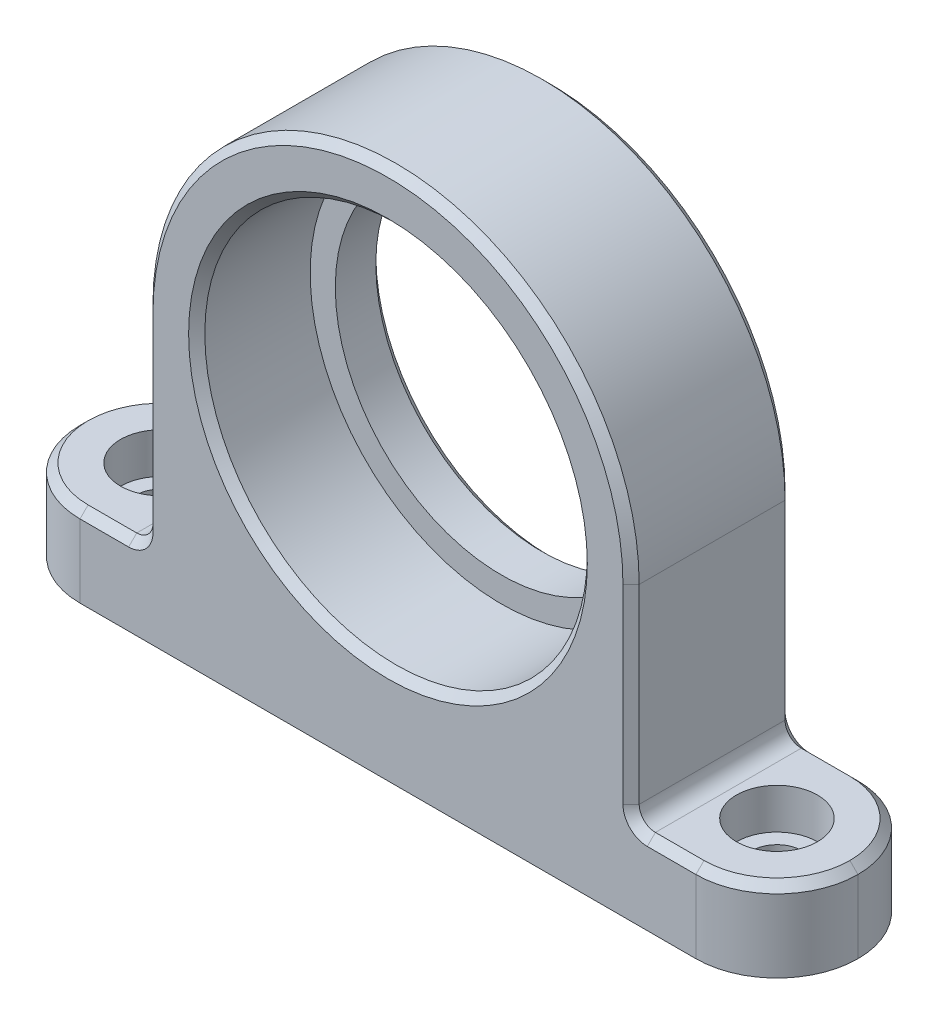
ISO-10303-21;
HEADER;
FILE_DESCRIPTION(('STEP AP214'),'2;1');
FILE_NAME('part.step','',(''),(''),'','','');
FILE_SCHEMA(('AUTOMOTIVE_DESIGN { 1 0 10303 214 1 1 1 1 }'));
ENDSEC;
DATA;
#1=APPLICATION_CONTEXT('core data for automotive mechanical design processes');
#2=APPLICATION_PROTOCOL_DEFINITION('international standard','automotive_design',2000,#1);
#3=PRODUCT_CONTEXT('',#1,'mechanical');
#4=PRODUCT('Part','Part','',(#3));
#5=PRODUCT_RELATED_PRODUCT_CATEGORY('part','',(#4));
#6=PRODUCT_DEFINITION_FORMATION('','',#4);
#7=PRODUCT_DEFINITION_CONTEXT('part definition',#1,'design');
#8=PRODUCT_DEFINITION('design','',#6,#7);
#9=PRODUCT_DEFINITION_SHAPE('','',#8);
#10=(LENGTH_UNIT() NAMED_UNIT(*) SI_UNIT(.MILLI.,.METRE.));
#11=(NAMED_UNIT(*) PLANE_ANGLE_UNIT() SI_UNIT($,.RADIAN.));
#12=(NAMED_UNIT(*) SI_UNIT($,.STERADIAN.) SOLID_ANGLE_UNIT());
#13=UNCERTAINTY_MEASURE_WITH_UNIT(LENGTH_MEASURE(1.E-05),#10,'distance_accuracy_value','');
#14=(GEOMETRIC_REPRESENTATION_CONTEXT(3) GLOBAL_UNCERTAINTY_ASSIGNED_CONTEXT((#13)) GLOBAL_UNIT_ASSIGNED_CONTEXT((#10,
#11,#12)) REPRESENTATION_CONTEXT('',''));
#15=CARTESIAN_POINT('',(0.,0.,0.));
#16=DIRECTION('',(0.,0.,1.));
#17=DIRECTION('',(1.,0.,0.));
#18=AXIS2_PLACEMENT_3D('',#15,#16,#17);
#19=CARTESIAN_POINT('',(-48.,10.,-10.));
#20=DIRECTION('',(0.,0.,-1.));
#21=DIRECTION('',(-1.,0.,0.));
#22=AXIS2_PLACEMENT_3D('',#19,#20,#21);
#23=PLANE('',#22);
#24=CARTESIAN_POINT('',(0.,35.5,-10.));
#25=DIRECTION('',(0.,0.,-1.));
#26=DIRECTION('',(-1.,0.,0.));
#27=AXIS2_PLACEMENT_3D('',#24,#25,#26);
#28=CIRCLE('',#27,21.5);
#29=CARTESIAN_POINT('',(-21.5,35.5,-10.));
#30=VERTEX_POINT('',#29);
#31=EDGE_CURVE('E383',#30,#30,#28,.F.);
#32=ORIENTED_EDGE('',*,*,#31,.T.);
#33=EDGE_LOOP('',(#32));
#34=FACE_BOUND('',#33,.T.);
#35=CARTESIAN_POINT('',(32.,12.,-10.));
#36=DIRECTION('',(0.,0.,-1.));
#37=DIRECTION('',(-1.,0.,0.));
#38=AXIS2_PLACEMENT_3D('',#35,#36,#37);
#39=CIRCLE('',#38,3.00000000000003);
#40=CARTESIAN_POINT('',(29.,12.,-10.));
#41=VERTEX_POINT('',#40);
#42=CARTESIAN_POINT('',(32.,8.99999999999997,-10.));
#43=VERTEX_POINT('',#42);
#44=EDGE_CURVE('E272',#41,#43,#39,.F.);
#45=ORIENTED_EDGE('',*,*,#44,.T.);
#46=DIRECTION('',(1.,0.,0.));
#47=VECTOR('',#46,1.);
#48=CARTESIAN_POINT('',(38.,8.99999999999997,-10.));
#49=LINE('',#48,#47);
#50=CARTESIAN_POINT('',(38.,8.99999999999997,-10.));
#51=VERTEX_POINT('',#50);
#52=EDGE_CURVE('E274',#43,#51,#49,.T.);
#53=ORIENTED_EDGE('',*,*,#52,.T.);
#54=DIRECTION('',(0.,-1.,0.));
#55=VECTOR('',#54,1.);
#56=CARTESIAN_POINT('',(38.,10.,-10.));
#57=LINE('',#56,#55);
#58=CARTESIAN_POINT('',(38.,0.,-10.));
#59=VERTEX_POINT('',#58);
#60=EDGE_CURVE('E198',#51,#59,#57,.T.);
#61=ORIENTED_EDGE('',*,*,#60,.T.);
#62=DIRECTION('',(1.,0.,0.));
#63=VECTOR('',#62,1.);
#64=CARTESIAN_POINT('',(-48.,0.,-10.));
#65=LINE('',#64,#63);
#66=CARTESIAN_POINT('',(-38.,0.,-10.));
#67=VERTEX_POINT('',#66);
#68=EDGE_CURVE('E191',#67,#59,#65,.T.);
#69=ORIENTED_EDGE('',*,*,#68,.F.);
#70=DIRECTION('',(0.,-1.,0.));
#71=VECTOR('',#70,1.);
#72=CARTESIAN_POINT('',(-38.,10.,-10.));
#73=LINE('',#72,#71);
#74=CARTESIAN_POINT('',(-38.,8.99999999999997,-10.));
#75=VERTEX_POINT('',#74);
#76=EDGE_CURVE('E202',#67,#75,#73,.F.);
#77=ORIENTED_EDGE('',*,*,#76,.T.);
#78=DIRECTION('',(1.,0.,0.));
#79=VECTOR('',#78,1.);
#80=CARTESIAN_POINT('',(-32.,8.99999999999997,-10.));
#81=LINE('',#80,#79);
#82=CARTESIAN_POINT('',(-32.,8.99999999999997,-10.));
#83=VERTEX_POINT('',#82);
#84=EDGE_CURVE('E261',#75,#83,#81,.T.);
#85=ORIENTED_EDGE('',*,*,#84,.T.);
#86=CARTESIAN_POINT('',(-32.,12.,-10.));
#87=DIRECTION('',(0.,0.,-1.));
#88=DIRECTION('',(-1.,0.,0.));
#89=AXIS2_PLACEMENT_3D('',#86,#87,#88);
#90=CIRCLE('',#89,3.00000000000003);
#91=CARTESIAN_POINT('',(-29.,12.,-10.));
#92=VERTEX_POINT('',#91);
#93=EDGE_CURVE('E263',#83,#92,#90,.F.);
#94=ORIENTED_EDGE('',*,*,#93,.T.);
#95=DIRECTION('',(0.,1.,0.));
#96=VECTOR('',#95,1.);
#97=CARTESIAN_POINT('',(-29.,35.5,-10.));
#98=LINE('',#97,#96);
#99=CARTESIAN_POINT('',(-29.,35.5,-10.));
#100=VERTEX_POINT('',#99);
#101=EDGE_CURVE('E265',#92,#100,#98,.T.);
#102=ORIENTED_EDGE('',*,*,#101,.T.);
#103=CARTESIAN_POINT('',(0.,35.5,-10.));
#104=DIRECTION('',(0.,0.,-1.));
#105=DIRECTION('',(-1.,0.,0.));
#106=AXIS2_PLACEMENT_3D('',#103,#104,#105);
#107=CIRCLE('',#106,29.);
#108=CARTESIAN_POINT('',(29.,35.5,-10.));
#109=VERTEX_POINT('',#108);
#110=EDGE_CURVE('E267',#100,#109,#107,.T.);
#111=ORIENTED_EDGE('',*,*,#110,.T.);
#112=DIRECTION('',(0.,-1.,0.));
#113=VECTOR('',#112,1.);
#114=CARTESIAN_POINT('',(29.,12.,-10.));
#115=LINE('',#114,#113);
#116=EDGE_CURVE('E270',#109,#41,#115,.T.);
#117=ORIENTED_EDGE('',*,*,#116,.T.);
#118=EDGE_LOOP('',(#45,#53,#61,#69,#77,#85,#94,#102,#111,#117));
#119=FACE_BOUND('',#118,.T.);
#120=ADVANCED_FACE('F42',(#34,#119),#23,.T.);
#121=CARTESIAN_POINT('',(-48.,10.,10.));
#122=DIRECTION('',(0.,0.,-1.));
#123=DIRECTION('',(-1.,0.,0.));
#124=AXIS2_PLACEMENT_3D('',#121,#122,#123);
#125=PLANE('',#124);
#126=CARTESIAN_POINT('',(0.,35.5,10.));
#127=DIRECTION('',(0.,0.,-1.));
#128=DIRECTION('',(-1.,0.,0.));
#129=AXIS2_PLACEMENT_3D('',#126,#127,#128);
#130=CIRCLE('',#129,24.6);
#131=CARTESIAN_POINT('',(-24.6,35.5,10.));
#132=VERTEX_POINT('',#131);
#133=EDGE_CURVE('E11',#132,#132,#130,.T.);
#134=ORIENTED_EDGE('',*,*,#133,.T.);
#135=EDGE_LOOP('',(#134));
#136=FACE_BOUND('',#135,.T.);
#137=DIRECTION('',(0.,-1.,0.));
#138=VECTOR('',#137,1.);
#139=CARTESIAN_POINT('',(38.,10.,10.));
#140=LINE('',#139,#138);
#141=CARTESIAN_POINT('',(38.,0.,10.));
#142=VERTEX_POINT('',#141);
#143=CARTESIAN_POINT('',(38.,8.99999999999997,10.));
#144=VERTEX_POINT('',#143);
#145=EDGE_CURVE('E224',#142,#144,#140,.F.);
#146=ORIENTED_EDGE('',*,*,#145,.T.);
#147=DIRECTION('',(-1.,0.,0.));
#148=VECTOR('',#147,1.);
#149=CARTESIAN_POINT('',(-48.,8.99999999999997,10.));
#150=LINE('',#149,#148);
#151=CARTESIAN_POINT('',(32.,8.99999999999997,10.));
#152=VERTEX_POINT('',#151);
#153=EDGE_CURVE('E58',#144,#152,#150,.T.);
#154=ORIENTED_EDGE('',*,*,#153,.T.);
#155=CARTESIAN_POINT('',(32.,12.,10.));
#156=DIRECTION('',(0.,0.,-1.));
#157=DIRECTION('',(-1.,0.,0.));
#158=AXIS2_PLACEMENT_3D('',#155,#156,#157);
#159=CIRCLE('',#158,3.00000000000003);
#160=CARTESIAN_POINT('',(29.,12.,10.));
#161=VERTEX_POINT('',#160);
#162=EDGE_CURVE('E322',#152,#161,#159,.T.);
#163=ORIENTED_EDGE('',*,*,#162,.T.);
#164=DIRECTION('',(0.,1.,0.));
#165=VECTOR('',#164,1.);
#166=CARTESIAN_POINT('',(29.,10.,10.));
#167=LINE('',#166,#165);
#168=CARTESIAN_POINT('',(29.,35.5,10.));
#169=VERTEX_POINT('',#168);
#170=EDGE_CURVE('E319',#161,#169,#167,.T.);
#171=ORIENTED_EDGE('',*,*,#170,.T.);
#172=CARTESIAN_POINT('',(0.,35.5,10.));
#173=DIRECTION('',(0.,0.,-1.));
#174=DIRECTION('',(-1.,0.,0.));
#175=AXIS2_PLACEMENT_3D('',#172,#173,#174);
#176=CIRCLE('',#175,29.);
#177=CARTESIAN_POINT('',(-29.,35.5,10.));
#178=VERTEX_POINT('',#177);
#179=EDGE_CURVE('E315',#169,#178,#176,.F.);
#180=ORIENTED_EDGE('',*,*,#179,.T.);
#181=DIRECTION('',(0.,-1.,0.));
#182=VECTOR('',#181,1.);
#183=CARTESIAN_POINT('',(-29.,10.,10.));
#184=LINE('',#183,#182);
#185=CARTESIAN_POINT('',(-29.,12.,10.));
#186=VERTEX_POINT('',#185);
#187=EDGE_CURVE('E317',#178,#186,#184,.T.);
#188=ORIENTED_EDGE('',*,*,#187,.T.);
#189=CARTESIAN_POINT('',(-32.,12.,10.));
#190=DIRECTION('',(0.,0.,-1.));
#191=DIRECTION('',(-1.,0.,0.));
#192=AXIS2_PLACEMENT_3D('',#189,#190,#191);
#193=CIRCLE('',#192,3.00000000000003);
#194=CARTESIAN_POINT('',(-32.,8.99999999999997,10.));
#195=VERTEX_POINT('',#194);
#196=EDGE_CURVE('E65',#186,#195,#193,.T.);
#197=ORIENTED_EDGE('',*,*,#196,.T.);
#198=DIRECTION('',(-1.,0.,0.));
#199=VECTOR('',#198,1.);
#200=CARTESIAN_POINT('',(-48.,8.99999999999997,10.));
#201=LINE('',#200,#199);
#202=CARTESIAN_POINT('',(-38.,8.99999999999997,10.));
#203=VERTEX_POINT('',#202);
#204=EDGE_CURVE('E324',#195,#203,#201,.T.);
#205=ORIENTED_EDGE('',*,*,#204,.T.);
#206=DIRECTION('',(0.,-1.,0.));
#207=VECTOR('',#206,1.);
#208=CARTESIAN_POINT('',(-38.,10.,10.));
#209=LINE('',#208,#207);
#210=CARTESIAN_POINT('',(-38.,0.,10.));
#211=VERTEX_POINT('',#210);
#212=EDGE_CURVE('E222',#203,#211,#209,.T.);
#213=ORIENTED_EDGE('',*,*,#212,.T.);
#214=DIRECTION('',(1.,0.,0.));
#215=VECTOR('',#214,1.);
#216=CARTESIAN_POINT('',(-48.,0.,10.));
#217=LINE('',#216,#215);
#218=EDGE_CURVE('E206',#211,#142,#217,.T.);
#219=ORIENTED_EDGE('',*,*,#218,.T.);
#220=EDGE_LOOP('',(#146,#154,#163,#171,#180,#188,#197,#205,#213,#219));
#221=FACE_BOUND('',#220,.T.);
#222=ADVANCED_FACE('F401',(#136,#221),#125,.F.);
#223=CARTESIAN_POINT('',(30.,65.5,10.));
#224=DIRECTION('',(-1.,0.,0.));
#225=DIRECTION('',(0.,0.,1.));
#226=AXIS2_PLACEMENT_3D('',#223,#224,#225);
#227=PLANE('',#226);
#228=DIRECTION('',(0.,0.,-1.));
#229=VECTOR('',#228,1.);
#230=CARTESIAN_POINT('',(30.,12.,-10.));
#231=LINE('',#230,#229);
#232=CARTESIAN_POINT('',(30.,12.,8.99999999999999));
#233=VERTEX_POINT('',#232);
#234=CARTESIAN_POINT('',(30.,12.,-8.99999999999998));
#235=VERTEX_POINT('',#234);
#236=EDGE_CURVE('E244',#233,#235,#231,.T.);
#237=ORIENTED_EDGE('',*,*,#236,.T.);
#238=DIRECTION('',(0.,1.,0.));
#239=VECTOR('',#238,1.);
#240=CARTESIAN_POINT('',(30.,35.5,-8.99999999999998));
#241=LINE('',#240,#239);
#242=CARTESIAN_POINT('',(30.,35.5,-8.99999999999998));
#243=VERTEX_POINT('',#242);
#244=EDGE_CURVE('E278',#235,#243,#241,.T.);
#245=ORIENTED_EDGE('',*,*,#244,.T.);
#246=DIRECTION('',(0.,0.,-1.));
#247=VECTOR('',#246,1.);
#248=CARTESIAN_POINT('',(30.,35.5,157.405955188384));
#249=LINE('',#248,#247);
#250=CARTESIAN_POINT('',(30.,35.5,8.99999999999998));
#251=VERTEX_POINT('',#250);
#252=EDGE_CURVE('E614',#251,#243,#249,.T.);
#253=ORIENTED_EDGE('',*,*,#252,.F.);
#254=DIRECTION('',(0.,-1.,0.));
#255=VECTOR('',#254,1.);
#256=CARTESIAN_POINT('',(30.,65.5,8.99999999999999));
#257=LINE('',#256,#255);
#258=EDGE_CURVE('E276',#251,#233,#257,.T.);
#259=ORIENTED_EDGE('',*,*,#258,.T.);
#260=EDGE_LOOP('',(#237,#245,#253,#259));
#261=FACE_BOUND('',#260,.T.);
#262=ADVANCED_FACE('F407',(#261),#227,.F.);
#263=CARTESIAN_POINT('',(0.,10.,0.));
#264=DIRECTION('',(0.,-1.,0.));
#265=DIRECTION('',(0.,0.,-1.));
#266=AXIS2_PLACEMENT_3D('',#263,#264,#265);
#267=PLANE('',#266);
#268=CARTESIAN_POINT('',(38.,10.,1.58206781009085E-13));
#269=DIRECTION('',(0.,1.,0.));
#270=DIRECTION('',(0.,0.,-1.));
#271=AXIS2_PLACEMENT_3D('',#268,#269,#270);
#272=CIRCLE('',#271,5.);
#273=CARTESIAN_POINT('',(38.,10.,-4.99999999999984));
#274=VERTEX_POINT('',#273);
#275=EDGE_CURVE('E229',#274,#274,#272,.T.);
#276=ORIENTED_EDGE('',*,*,#275,.F.);
#277=EDGE_LOOP('',(#276));
#278=FACE_BOUND('',#277,.T.);
#279=CARTESIAN_POINT('',(38.,10.,0.));
#280=DIRECTION('',(0.,-1.,0.));
#281=DIRECTION('',(0.,0.,-1.));
#282=AXIS2_PLACEMENT_3D('',#279,#280,#281);
#283=CIRCLE('',#282,8.99999999999998);
#284=CARTESIAN_POINT('',(47.,10.,0.));
#285=VERTEX_POINT('',#284);
#286=CARTESIAN_POINT('',(38.,10.,-8.99999999999998));
#287=VERTEX_POINT('',#286);
#288=EDGE_CURVE('E296',#285,#287,#283,.F.);
#289=ORIENTED_EDGE('',*,*,#288,.T.);
#290=DIRECTION('',(-1.,0.,0.));
#291=VECTOR('',#290,1.);
#292=CARTESIAN_POINT('',(32.,10.,-8.99999999999998));
#293=LINE('',#292,#291);
#294=CARTESIAN_POINT('',(32.,10.,-8.99999999999998));
#295=VERTEX_POINT('',#294);
#296=EDGE_CURVE('E298',#287,#295,#293,.T.);
#297=ORIENTED_EDGE('',*,*,#296,.T.);
#298=DIRECTION('',(0.,0.,-1.));
#299=VECTOR('',#298,1.);
#300=CARTESIAN_POINT('',(32.,10.,10.));
#301=LINE('',#300,#299);
#302=CARTESIAN_POINT('',(32.,10.,8.99999999999999));
#303=VERTEX_POINT('',#302);
#304=EDGE_CURVE('E247',#295,#303,#301,.F.);
#305=ORIENTED_EDGE('',*,*,#304,.T.);
#306=DIRECTION('',(1.,0.,0.));
#307=VECTOR('',#306,1.);
#308=CARTESIAN_POINT('',(0.,10.,8.99999999999999));
#309=LINE('',#308,#307);
#310=CARTESIAN_POINT('',(38.,10.,8.99999999999999));
#311=VERTEX_POINT('',#310);
#312=EDGE_CURVE('E292',#303,#311,#309,.T.);
#313=ORIENTED_EDGE('',*,*,#312,.T.);
#314=CARTESIAN_POINT('',(38.,10.,0.));
#315=DIRECTION('',(0.,-1.,0.));
#316=DIRECTION('',(0.,0.,-1.));
#317=AXIS2_PLACEMENT_3D('',#314,#315,#316);
#318=CIRCLE('',#317,8.99999999999998);
#319=EDGE_CURVE('E294',#311,#285,#318,.F.);
#320=ORIENTED_EDGE('',*,*,#319,.T.);
#321=EDGE_LOOP('',(#289,#297,#305,#313,#320));
#322=FACE_BOUND('',#321,.T.);
#323=ADVANCED_FACE('F601',(#278,#322),#267,.F.);
#324=CARTESIAN_POINT('',(-38.,10.,0.));
#325=DIRECTION('',(0.,1.,0.));
#326=DIRECTION('',(0.,0.,1.));
#327=AXIS2_PLACEMENT_3D('',#324,#325,#326);
#328=CIRCLE('',#327,5.);
#329=CARTESIAN_POINT('',(-38.,10.,5.));
#330=VERTEX_POINT('',#329);
#331=EDGE_CURVE('E632',#330,#330,#328,.T.);
#332=ORIENTED_EDGE('',*,*,#331,.F.);
#333=EDGE_LOOP('',(#332));
#334=FACE_BOUND('',#333,.T.);
#335=DIRECTION('',(0.,0.,1.));
#336=VECTOR('',#335,1.);
#337=CARTESIAN_POINT('',(-32.,10.,-10.));
#338=LINE('',#337,#336);
#339=CARTESIAN_POINT('',(-32.,10.,8.99999999999999));
#340=VERTEX_POINT('',#339);
#341=CARTESIAN_POINT('',(-32.,10.,-8.99999999999998));
#342=VERTEX_POINT('',#341);
#343=EDGE_CURVE('E253',#340,#342,#338,.F.);
#344=ORIENTED_EDGE('',*,*,#343,.T.);
#345=DIRECTION('',(-1.,0.,0.));
#346=VECTOR('',#345,1.);
#347=CARTESIAN_POINT('',(-38.,10.,-8.99999999999998));
#348=LINE('',#347,#346);
#349=CARTESIAN_POINT('',(-38.,10.,-8.99999999999998));
#350=VERTEX_POINT('',#349);
#351=EDGE_CURVE('E306',#342,#350,#348,.T.);
#352=ORIENTED_EDGE('',*,*,#351,.T.);
#353=CARTESIAN_POINT('',(-38.,10.,0.));
#354=DIRECTION('',(0.,-1.,0.));
#355=DIRECTION('',(0.,0.,-1.));
#356=AXIS2_PLACEMENT_3D('',#353,#354,#355);
#357=CIRCLE('',#356,8.99999999999998);
#358=CARTESIAN_POINT('',(-47.,10.,0.));
#359=VERTEX_POINT('',#358);
#360=EDGE_CURVE('E304',#350,#359,#357,.F.);
#361=ORIENTED_EDGE('',*,*,#360,.T.);
#362=CARTESIAN_POINT('',(-38.,10.,0.));
#363=DIRECTION('',(0.,-1.,0.));
#364=DIRECTION('',(0.,0.,-1.));
#365=AXIS2_PLACEMENT_3D('',#362,#363,#364);
#366=CIRCLE('',#365,8.99999999999998);
#367=CARTESIAN_POINT('',(-38.,10.,8.99999999999999));
#368=VERTEX_POINT('',#367);
#369=EDGE_CURVE('E302',#359,#368,#366,.F.);
#370=ORIENTED_EDGE('',*,*,#369,.T.);
#371=DIRECTION('',(1.,0.,0.));
#372=VECTOR('',#371,1.);
#373=CARTESIAN_POINT('',(0.,10.,8.99999999999999));
#374=LINE('',#373,#372);
#375=EDGE_CURVE('E300',#368,#340,#374,.T.);
#376=ORIENTED_EDGE('',*,*,#375,.T.);
#377=EDGE_LOOP('',(#344,#352,#361,#370,#376));
#378=FACE_BOUND('',#377,.T.);
#379=ADVANCED_FACE('F644',(#334,#378),#267,.F.);
#380=CARTESIAN_POINT('',(0.,0.,0.));
#381=DIRECTION('',(0.,-1.,0.));
#382=DIRECTION('',(0.,0.,-1.));
#383=AXIS2_PLACEMENT_3D('',#380,#381,#382);
#384=PLANE('',#383);
#385=CARTESIAN_POINT('',(38.,0.,1.58206781009085E-13));
#386=DIRECTION('',(0.,-1.,0.));
#387=DIRECTION('',(0.,0.,-1.));
#388=AXIS2_PLACEMENT_3D('',#385,#386,#387);
#389=CIRCLE('',#388,4.10000000000001);
#390=CARTESIAN_POINT('',(38.,0.,-4.09999999999985));
#391=VERTEX_POINT('',#390);
#392=EDGE_CURVE('E235',#391,#391,#389,.F.);
#393=ORIENTED_EDGE('',*,*,#392,.T.);
#394=EDGE_LOOP('',(#393));
#395=FACE_BOUND('',#394,.T.);
#396=CARTESIAN_POINT('',(-38.,0.,0.));
#397=DIRECTION('',(0.,-1.,0.));
#398=DIRECTION('',(0.,0.,-1.));
#399=AXIS2_PLACEMENT_3D('',#396,#397,#398);
#400=CIRCLE('',#399,4.10000000000001);
#401=CARTESIAN_POINT('',(-38.,0.,-4.10000000000001));
#402=VERTEX_POINT('',#401);
#403=EDGE_CURVE('E226',#402,#402,#400,.F.);
#404=ORIENTED_EDGE('',*,*,#403,.T.);
#405=EDGE_LOOP('',(#404));
#406=FACE_BOUND('',#405,.T.);
#407=ORIENTED_EDGE('',*,*,#68,.T.);
#408=CARTESIAN_POINT('',(38.,0.,0.));
#409=DIRECTION('',(0.,-1.,0.));
#410=DIRECTION('',(0.,0.,-1.));
#411=AXIS2_PLACEMENT_3D('',#408,#409,#410);
#412=CIRCLE('',#411,10.);
#413=CARTESIAN_POINT('',(48.,0.,0.));
#414=VERTEX_POINT('',#413);
#415=EDGE_CURVE('E220',#59,#414,#412,.T.);
#416=ORIENTED_EDGE('',*,*,#415,.T.);
#417=CARTESIAN_POINT('',(38.,0.,0.));
#418=DIRECTION('',(0.,-1.,0.));
#419=DIRECTION('',(0.,0.,-1.));
#420=AXIS2_PLACEMENT_3D('',#417,#418,#419);
#421=CIRCLE('',#420,10.);
#422=EDGE_CURVE('E218',#414,#142,#421,.T.);
#423=ORIENTED_EDGE('',*,*,#422,.T.);
#424=ORIENTED_EDGE('',*,*,#218,.F.);
#425=CARTESIAN_POINT('',(-38.,0.,0.));
#426=DIRECTION('',(0.,-1.,0.));
#427=DIRECTION('',(0.,0.,-1.));
#428=AXIS2_PLACEMENT_3D('',#425,#426,#427);
#429=CIRCLE('',#428,10.);
#430=CARTESIAN_POINT('',(-48.,0.,0.));
#431=VERTEX_POINT('',#430);
#432=EDGE_CURVE('E194',#211,#431,#429,.T.);
#433=ORIENTED_EDGE('',*,*,#432,.T.);
#434=CARTESIAN_POINT('',(-38.,0.,0.));
#435=DIRECTION('',(0.,-1.,0.));
#436=DIRECTION('',(0.,0.,-1.));
#437=AXIS2_PLACEMENT_3D('',#434,#435,#436);
#438=CIRCLE('',#437,10.);
#439=EDGE_CURVE('E187',#431,#67,#438,.T.);
#440=ORIENTED_EDGE('',*,*,#439,.T.);
#441=EDGE_LOOP('',(#407,#416,#423,#424,#433,#440));
#442=FACE_BOUND('',#441,.T.);
#443=ADVANCED_FACE('F189',(#395,#406,#442),#384,.T.);
#444=CARTESIAN_POINT('',(38.,5.,1.58206781009085E-13));
#445=DIRECTION('',(0.,1.,0.));
#446=DIRECTION('',(0.,0.,1.));
#447=AXIS2_PLACEMENT_3D('',#444,#445,#446);
#448=CYLINDRICAL_SURFACE('',#447,5.);
#449=CARTESIAN_POINT('',(38.,5.,1.58206781009085E-13));
#450=DIRECTION('',(0.,1.,0.));
#451=DIRECTION('',(0.,0.,-1.));
#452=AXIS2_PLACEMENT_3D('',#449,#450,#451);
#453=CIRCLE('',#452,5.);
#454=CARTESIAN_POINT('',(38.,5.,-4.99999999999984));
#455=VERTEX_POINT('',#454);
#456=EDGE_CURVE('E635',#455,#455,#453,.T.);
#457=ORIENTED_EDGE('',*,*,#456,.F.);
#458=EDGE_LOOP('',(#457));
#459=FACE_BOUND('',#458,.T.);
#460=ORIENTED_EDGE('',*,*,#275,.T.);
#461=EDGE_LOOP('',(#460));
#462=FACE_BOUND('',#461,.T.);
#463=ADVANCED_FACE('F641',(#459,#462),#448,.F.);
#464=CARTESIAN_POINT('',(38.,5.,1.58206781009085E-13));
#465=DIRECTION('',(0.,-1.,0.));
#466=DIRECTION('',(0.,0.,-1.));
#467=AXIS2_PLACEMENT_3D('',#464,#465,#466);
#468=PLANE('',#467);
#469=CARTESIAN_POINT('',(38.,5.,1.58206781009085E-13));
#470=DIRECTION('',(0.,1.,0.));
#471=DIRECTION('',(0.,0.,1.));
#472=AXIS2_PLACEMENT_3D('',#469,#470,#471);
#473=CIRCLE('',#472,3.1);
#474=CARTESIAN_POINT('',(38.,5.,3.10000000000016));
#475=VERTEX_POINT('',#474);
#476=EDGE_CURVE('E621',#475,#475,#473,.T.);
#477=ORIENTED_EDGE('',*,*,#476,.F.);
#478=EDGE_LOOP('',(#477));
#479=FACE_BOUND('',#478,.T.);
#480=ORIENTED_EDGE('',*,*,#456,.T.);
#481=EDGE_LOOP('',(#480));
#482=FACE_BOUND('',#481,.T.);
#483=ADVANCED_FACE('F659',(#479,#482),#468,.F.);
#484=CARTESIAN_POINT('',(-38.,5.,0.));
#485=DIRECTION('',(0.,1.,0.));
#486=DIRECTION('',(0.,0.,1.));
#487=AXIS2_PLACEMENT_3D('',#484,#485,#486);
#488=CYLINDRICAL_SURFACE('',#487,5.);
#489=CARTESIAN_POINT('',(-38.,5.,0.));
#490=DIRECTION('',(0.,1.,0.));
#491=DIRECTION('',(0.,0.,1.));
#492=AXIS2_PLACEMENT_3D('',#489,#490,#491);
#493=CIRCLE('',#492,5.);
#494=CARTESIAN_POINT('',(-38.,5.,5.));
#495=VERTEX_POINT('',#494);
#496=EDGE_CURVE('E207',#495,#495,#493,.T.);
#497=ORIENTED_EDGE('',*,*,#496,.F.);
#498=EDGE_LOOP('',(#497));
#499=FACE_BOUND('',#498,.T.);
#500=ORIENTED_EDGE('',*,*,#331,.T.);
#501=EDGE_LOOP('',(#500));
#502=FACE_BOUND('',#501,.T.);
#503=ADVANCED_FACE('F669',(#499,#502),#488,.F.);
#504=CARTESIAN_POINT('',(-38.,5.,0.));
#505=DIRECTION('',(0.,1.,0.));
#506=DIRECTION('',(0.,0.,1.));
#507=AXIS2_PLACEMENT_3D('',#504,#505,#506);
#508=PLANE('',#507);
#509=CARTESIAN_POINT('',(-38.,5.,0.));
#510=DIRECTION('',(0.,1.,0.));
#511=DIRECTION('',(0.,0.,1.));
#512=AXIS2_PLACEMENT_3D('',#509,#510,#511);
#513=CIRCLE('',#512,3.1);
#514=CARTESIAN_POINT('',(-38.,5.,3.1));
#515=VERTEX_POINT('',#514);
#516=EDGE_CURVE('E232',#515,#515,#513,.T.);
#517=ORIENTED_EDGE('',*,*,#516,.F.);
#518=EDGE_LOOP('',(#517));
#519=FACE_BOUND('',#518,.T.);
#520=ORIENTED_EDGE('',*,*,#496,.T.);
#521=EDGE_LOOP('',(#520));
#522=FACE_BOUND('',#521,.T.);
#523=ADVANCED_FACE('F419',(#519,#522),#508,.T.);
#524=CARTESIAN_POINT('',(38.,10.,0.));
#525=DIRECTION('',(0.,1.,0.));
#526=DIRECTION('',(0.,0.,1.));
#527=AXIS2_PLACEMENT_3D('',#524,#525,#526);
#528=CYLINDRICAL_SURFACE('',#527,10.);
#529=DIRECTION('',(0.,-1.,0.));
#530=VECTOR('',#529,1.);
#531=CARTESIAN_POINT('',(48.,0.,0.));
#532=LINE('',#531,#530);
#533=CARTESIAN_POINT('',(48.,8.99999999999997,0.));
#534=VERTEX_POINT('',#533);
#535=EDGE_CURVE('E227',#534,#414,#532,.T.);
#536=ORIENTED_EDGE('',*,*,#535,.F.);
#537=CARTESIAN_POINT('',(38.,8.99999999999997,0.));
#538=DIRECTION('',(0.,-1.,0.));
#539=DIRECTION('',(0.,0.,-1.));
#540=AXIS2_PLACEMENT_3D('',#537,#538,#539);
#541=CIRCLE('',#540,10.);
#542=EDGE_CURVE('E311',#534,#144,#541,.T.);
#543=ORIENTED_EDGE('',*,*,#542,.T.);
#544=ORIENTED_EDGE('',*,*,#145,.F.);
#545=ORIENTED_EDGE('',*,*,#422,.F.);
#546=EDGE_LOOP('',(#536,#543,#544,#545));
#547=FACE_BOUND('',#546,.T.);
#548=ADVANCED_FACE('F415',(#547),#528,.T.);
#549=CARTESIAN_POINT('',(38.,10.,0.));
#550=DIRECTION('',(0.,-1.,0.));
#551=DIRECTION('',(0.,0.,-1.));
#552=AXIS2_PLACEMENT_3D('',#549,#550,#551);
#553=CYLINDRICAL_SURFACE('',#552,10.);
#554=ORIENTED_EDGE('',*,*,#60,.F.);
#555=CARTESIAN_POINT('',(38.,8.99999999999997,0.));
#556=DIRECTION('',(0.,-1.,0.));
#557=DIRECTION('',(0.,0.,-1.));
#558=AXIS2_PLACEMENT_3D('',#555,#556,#557);
#559=CIRCLE('',#558,10.);
#560=EDGE_CURVE('E308',#51,#534,#559,.T.);
#561=ORIENTED_EDGE('',*,*,#560,.T.);
#562=ORIENTED_EDGE('',*,*,#535,.T.);
#563=ORIENTED_EDGE('',*,*,#415,.F.);
#564=EDGE_LOOP('',(#554,#561,#562,#563));
#565=FACE_BOUND('',#564,.T.);
#566=ADVANCED_FACE('F412',(#565),#553,.T.);
#567=CARTESIAN_POINT('',(-38.,10.,0.));
#568=DIRECTION('',(0.,1.,0.));
#569=DIRECTION('',(0.,0.,1.));
#570=AXIS2_PLACEMENT_3D('',#567,#568,#569);
#571=CYLINDRICAL_SURFACE('',#570,10.);
#572=DIRECTION('',(0.,-1.,0.));
#573=VECTOR('',#572,1.);
#574=CARTESIAN_POINT('',(-48.,0.,0.));
#575=LINE('',#574,#573);
#576=CARTESIAN_POINT('',(-48.,8.99999999999997,0.));
#577=VERTEX_POINT('',#576);
#578=EDGE_CURVE('E230',#577,#431,#575,.T.);
#579=ORIENTED_EDGE('',*,*,#578,.F.);
#580=CARTESIAN_POINT('',(-38.,8.99999999999997,0.));
#581=DIRECTION('',(0.,-1.,0.));
#582=DIRECTION('',(0.,0.,-1.));
#583=AXIS2_PLACEMENT_3D('',#580,#581,#582);
#584=CIRCLE('',#583,10.);
#585=EDGE_CURVE('E211',#577,#75,#584,.T.);
#586=ORIENTED_EDGE('',*,*,#585,.T.);
#587=ORIENTED_EDGE('',*,*,#76,.F.);
#588=ORIENTED_EDGE('',*,*,#439,.F.);
#589=EDGE_LOOP('',(#579,#586,#587,#588));
#590=FACE_BOUND('',#589,.T.);
#591=ADVANCED_FACE('F209',(#590),#571,.T.);
#592=CARTESIAN_POINT('',(-38.,10.,0.));
#593=DIRECTION('',(0.,-1.,0.));
#594=DIRECTION('',(0.,0.,-1.));
#595=AXIS2_PLACEMENT_3D('',#592,#593,#594);
#596=CYLINDRICAL_SURFACE('',#595,10.);
#597=ORIENTED_EDGE('',*,*,#212,.F.);
#598=CARTESIAN_POINT('',(-38.,8.99999999999997,0.));
#599=DIRECTION('',(0.,-1.,0.));
#600=DIRECTION('',(0.,0.,-1.));
#601=AXIS2_PLACEMENT_3D('',#598,#599,#600);
#602=CIRCLE('',#601,10.);
#603=EDGE_CURVE('E313',#203,#577,#602,.T.);
#604=ORIENTED_EDGE('',*,*,#603,.T.);
#605=ORIENTED_EDGE('',*,*,#578,.T.);
#606=ORIENTED_EDGE('',*,*,#432,.F.);
#607=EDGE_LOOP('',(#597,#604,#605,#606));
#608=FACE_BOUND('',#607,.T.);
#609=ADVANCED_FACE('F421',(#608),#596,.T.);
#610=CARTESIAN_POINT('',(38.,0.,1.58206781009085E-13));
#611=DIRECTION('',(0.,1.,0.));
#612=DIRECTION('',(0.,0.,1.));
#613=AXIS2_PLACEMENT_3D('',#610,#611,#612);
#614=CYLINDRICAL_SURFACE('',#613,3.1);
#615=CARTESIAN_POINT('',(38.,0.999999999999994,1.58206781009085E-13));
#616=DIRECTION('',(0.,-1.,0.));
#617=DIRECTION('',(0.,0.,-1.));
#618=AXIS2_PLACEMENT_3D('',#615,#616,#617);
#619=CIRCLE('',#618,3.1);
#620=CARTESIAN_POINT('',(38.,0.999999999999994,-3.09999999999984));
#621=VERTEX_POINT('',#620);
#622=EDGE_CURVE('E238',#621,#621,#619,.T.);
#623=ORIENTED_EDGE('',*,*,#622,.T.);
#624=EDGE_LOOP('',(#623));
#625=FACE_BOUND('',#624,.T.);
#626=ORIENTED_EDGE('',*,*,#476,.T.);
#627=EDGE_LOOP('',(#626));
#628=FACE_BOUND('',#627,.T.);
#629=ADVANCED_FACE('F424',(#625,#628),#614,.F.);
#630=CARTESIAN_POINT('',(-38.,0.,0.));
#631=DIRECTION('',(0.,1.,0.));
#632=DIRECTION('',(0.,0.,1.));
#633=AXIS2_PLACEMENT_3D('',#630,#631,#632);
#634=CYLINDRICAL_SURFACE('',#633,3.1);
#635=CARTESIAN_POINT('',(-38.,0.999999999999994,0.));
#636=DIRECTION('',(0.,-1.,0.));
#637=DIRECTION('',(0.,0.,-1.));
#638=AXIS2_PLACEMENT_3D('',#635,#636,#637);
#639=CIRCLE('',#638,3.1);
#640=CARTESIAN_POINT('',(-38.,0.999999999999994,-3.1));
#641=VERTEX_POINT('',#640);
#642=EDGE_CURVE('E241',#641,#641,#639,.T.);
#643=ORIENTED_EDGE('',*,*,#642,.T.);
#644=EDGE_LOOP('',(#643));
#645=FACE_BOUND('',#644,.T.);
#646=ORIENTED_EDGE('',*,*,#516,.T.);
#647=EDGE_LOOP('',(#646));
#648=FACE_BOUND('',#647,.T.);
#649=ADVANCED_FACE('F436',(#645,#648),#634,.F.);
#650=CARTESIAN_POINT('',(38.,0.,1.58206781009085E-13));
#651=DIRECTION('',(0.,-1.,0.));
#652=DIRECTION('',(0.,0.,-1.));
#653=AXIS2_PLACEMENT_3D('',#650,#651,#652);
#654=CONICAL_SURFACE('',#653,4.10000000000001,0.785398163397454);
#655=ORIENTED_EDGE('',*,*,#622,.F.);
#656=EDGE_LOOP('',(#655));
#657=FACE_BOUND('',#656,.T.);
#658=ORIENTED_EDGE('',*,*,#392,.F.);
#659=EDGE_LOOP('',(#658));
#660=FACE_BOUND('',#659,.T.);
#661=ADVANCED_FACE('F429',(#657,#660),#654,.F.);
#662=CARTESIAN_POINT('',(-38.,0.,0.));
#663=DIRECTION('',(0.,-1.,0.));
#664=DIRECTION('',(0.,0.,-1.));
#665=AXIS2_PLACEMENT_3D('',#662,#663,#664);
#666=CONICAL_SURFACE('',#665,4.10000000000001,0.785398163397454);
#667=ORIENTED_EDGE('',*,*,#642,.F.);
#668=EDGE_LOOP('',(#667));
#669=FACE_BOUND('',#668,.T.);
#670=ORIENTED_EDGE('',*,*,#403,.F.);
#671=EDGE_LOOP('',(#670));
#672=FACE_BOUND('',#671,.T.);
#673=ADVANCED_FACE('F435',(#669,#672),#666,.F.);
#674=CARTESIAN_POINT('',(-30.,65.5,10.));
#675=DIRECTION('',(1.,0.,0.));
#676=DIRECTION('',(0.,0.,-1.));
#677=AXIS2_PLACEMENT_3D('',#674,#675,#676);
#678=PLANE('',#677);
#679=DIRECTION('',(0.,0.,-1.));
#680=VECTOR('',#679,1.);
#681=CARTESIAN_POINT('',(-30.,35.5,157.405955188384));
#682=LINE('',#681,#680);
#683=CARTESIAN_POINT('',(-30.,35.5,8.99999999999998));
#684=VERTEX_POINT('',#683);
#685=CARTESIAN_POINT('',(-30.,35.5,-8.99999999999998));
#686=VERTEX_POINT('',#685);
#687=EDGE_CURVE('E617',#684,#686,#682,.T.);
#688=ORIENTED_EDGE('',*,*,#687,.T.);
#689=DIRECTION('',(0.,-1.,0.));
#690=VECTOR('',#689,1.);
#691=CARTESIAN_POINT('',(-30.,12.,-8.99999999999998));
#692=LINE('',#691,#690);
#693=CARTESIAN_POINT('',(-30.,12.,-8.99999999999998));
#694=VERTEX_POINT('',#693);
#695=EDGE_CURVE('E282',#686,#694,#692,.T.);
#696=ORIENTED_EDGE('',*,*,#695,.T.);
#697=DIRECTION('',(0.,0.,1.));
#698=VECTOR('',#697,1.);
#699=CARTESIAN_POINT('',(-30.,12.,10.));
#700=LINE('',#699,#698);
#701=CARTESIAN_POINT('',(-30.,12.,8.99999999999999));
#702=VERTEX_POINT('',#701);
#703=EDGE_CURVE('E250',#694,#702,#700,.T.);
#704=ORIENTED_EDGE('',*,*,#703,.T.);
#705=DIRECTION('',(0.,1.,0.));
#706=VECTOR('',#705,1.);
#707=CARTESIAN_POINT('',(-30.,65.5,8.99999999999999));
#708=LINE('',#707,#706);
#709=EDGE_CURVE('E280',#702,#684,#708,.T.);
#710=ORIENTED_EDGE('',*,*,#709,.T.);
#711=EDGE_LOOP('',(#688,#696,#704,#710));
#712=FACE_BOUND('',#711,.T.);
#713=ADVANCED_FACE('F443',(#712),#678,.F.);
#714=CARTESIAN_POINT('',(0.,35.5,157.405955188384));
#715=DIRECTION('',(0.,0.,-1.));
#716=DIRECTION('',(-1.,0.,0.));
#717=AXIS2_PLACEMENT_3D('',#714,#715,#716);
#718=CYLINDRICAL_SURFACE('',#717,30.);
#719=ORIENTED_EDGE('',*,*,#252,.T.);
#720=CARTESIAN_POINT('',(0.,35.5,-8.99999999999998));
#721=DIRECTION('',(0.,0.,-1.));
#722=DIRECTION('',(-1.,0.,0.));
#723=AXIS2_PLACEMENT_3D('',#720,#721,#722);
#724=CIRCLE('',#723,30.);
#725=EDGE_CURVE('E258',#243,#686,#724,.F.);
#726=ORIENTED_EDGE('',*,*,#725,.T.);
#727=ORIENTED_EDGE('',*,*,#687,.F.);
#728=CARTESIAN_POINT('',(0.,35.5,8.99999999999998));
#729=DIRECTION('',(0.,0.,-1.));
#730=DIRECTION('',(-1.,0.,0.));
#731=AXIS2_PLACEMENT_3D('',#728,#729,#730);
#732=CIRCLE('',#731,30.);
#733=EDGE_CURVE('E256',#684,#251,#732,.T.);
#734=ORIENTED_EDGE('',*,*,#733,.T.);
#735=EDGE_LOOP('',(#719,#726,#727,#734));
#736=FACE_BOUND('',#735,.T.);
#737=ADVANCED_FACE('F691',(#736),#718,.T.);
#738=CARTESIAN_POINT('',(0.,35.5,-4.));
#739=DIRECTION('',(0.,0.,1.));
#740=DIRECTION('',(1.,0.,0.));
#741=AXIS2_PLACEMENT_3D('',#738,#739,#740);
#742=CYLINDRICAL_SURFACE('',#741,23.6);
#743=CARTESIAN_POINT('',(0.,35.5,8.99999999999999));
#744=DIRECTION('',(0.,0.,-1.));
#745=DIRECTION('',(-1.,0.,0.));
#746=AXIS2_PLACEMENT_3D('',#743,#744,#745);
#747=CIRCLE('',#746,23.6);
#748=CARTESIAN_POINT('',(-23.6,35.5,8.99999999999999));
#749=VERTEX_POINT('',#748);
#750=EDGE_CURVE('E51',#749,#749,#747,.F.);
#751=ORIENTED_EDGE('',*,*,#750,.T.);
#752=EDGE_LOOP('',(#751));
#753=FACE_BOUND('',#752,.T.);
#754=CARTESIAN_POINT('',(0.,35.5,-4.));
#755=DIRECTION('',(0.,0.,1.));
#756=DIRECTION('',(1.,0.,0.));
#757=AXIS2_PLACEMENT_3D('',#754,#755,#756);
#758=CIRCLE('',#757,23.6);
#759=CARTESIAN_POINT('',(23.6,35.5,-4.));
#760=VERTEX_POINT('',#759);
#761=EDGE_CURVE('E618',#760,#760,#758,.T.);
#762=ORIENTED_EDGE('',*,*,#761,.F.);
#763=EDGE_LOOP('',(#762));
#764=FACE_BOUND('',#763,.T.);
#765=ADVANCED_FACE('F388',(#753,#764),#742,.F.);
#766=CARTESIAN_POINT('',(0.,35.5,-4.));
#767=DIRECTION('',(0.,0.,1.));
#768=DIRECTION('',(1.,0.,0.));
#769=AXIS2_PLACEMENT_3D('',#766,#767,#768);
#770=PLANE('',#769);
#771=CARTESIAN_POINT('',(0.,35.5,-4.));
#772=DIRECTION('',(0.,0.,1.));
#773=DIRECTION('',(1.,0.,0.));
#774=AXIS2_PLACEMENT_3D('',#771,#772,#773);
#775=CIRCLE('',#774,20.5);
#776=CARTESIAN_POINT('',(20.5,35.5,-4.));
#777=VERTEX_POINT('',#776);
#778=EDGE_CURVE('E380',#777,#777,#775,.T.);
#779=ORIENTED_EDGE('',*,*,#778,.F.);
#780=EDGE_LOOP('',(#779));
#781=FACE_BOUND('',#780,.T.);
#782=ORIENTED_EDGE('',*,*,#761,.T.);
#783=EDGE_LOOP('',(#782));
#784=FACE_BOUND('',#783,.T.);
#785=ADVANCED_FACE('F697',(#781,#784),#770,.T.);
#786=CARTESIAN_POINT('',(0.,35.5,-14.));
#787=DIRECTION('',(0.,0.,1.));
#788=DIRECTION('',(1.,0.,0.));
#789=AXIS2_PLACEMENT_3D('',#786,#787,#788);
#790=CYLINDRICAL_SURFACE('',#789,20.5);
#791=CARTESIAN_POINT('',(0.,35.5,-8.99999999999999));
#792=DIRECTION('',(0.,0.,-1.));
#793=DIRECTION('',(-1.,0.,0.));
#794=AXIS2_PLACEMENT_3D('',#791,#792,#793);
#795=CIRCLE('',#794,20.5);
#796=CARTESIAN_POINT('',(-20.5,35.5,-8.99999999999999));
#797=VERTEX_POINT('',#796);
#798=EDGE_CURVE('E327',#797,#797,#795,.T.);
#799=ORIENTED_EDGE('',*,*,#798,.T.);
#800=EDGE_LOOP('',(#799));
#801=FACE_BOUND('',#800,.T.);
#802=ORIENTED_EDGE('',*,*,#778,.T.);
#803=EDGE_LOOP('',(#802));
#804=FACE_BOUND('',#803,.T.);
#805=ADVANCED_FACE('F449',(#801,#804),#790,.F.);
#806=CARTESIAN_POINT('',(32.,12.,10.));
#807=DIRECTION('',(0.,0.,1.));
#808=DIRECTION('',(1.,0.,0.));
#809=AXIS2_PLACEMENT_3D('',#806,#807,#808);
#810=CYLINDRICAL_SURFACE('',#809,2.);
#811=ORIENTED_EDGE('',*,*,#304,.F.);
#812=CARTESIAN_POINT('',(32.,12.,-8.99999999999998));
#813=DIRECTION('',(0.,0.,-1.));
#814=DIRECTION('',(-1.,0.,0.));
#815=AXIS2_PLACEMENT_3D('',#812,#813,#814);
#816=CIRCLE('',#815,2.);
#817=EDGE_CURVE('E286',#295,#235,#816,.T.);
#818=ORIENTED_EDGE('',*,*,#817,.T.);
#819=ORIENTED_EDGE('',*,*,#236,.F.);
#820=CARTESIAN_POINT('',(32.,12.,8.99999999999999));
#821=DIRECTION('',(0.,0.,-1.));
#822=DIRECTION('',(-1.,0.,0.));
#823=AXIS2_PLACEMENT_3D('',#820,#821,#822);
#824=CIRCLE('',#823,2.);
#825=EDGE_CURVE('E284',#233,#303,#824,.F.);
#826=ORIENTED_EDGE('',*,*,#825,.T.);
#827=EDGE_LOOP('',(#811,#818,#819,#826));
#828=FACE_BOUND('',#827,.T.);
#829=ADVANCED_FACE('F445',(#828),#810,.F.);
#830=CARTESIAN_POINT('',(-32.,12.,10.));
#831=DIRECTION('',(0.,0.,-1.));
#832=DIRECTION('',(-1.,0.,0.));
#833=AXIS2_PLACEMENT_3D('',#830,#831,#832);
#834=CYLINDRICAL_SURFACE('',#833,2.);
#835=ORIENTED_EDGE('',*,*,#703,.F.);
#836=CARTESIAN_POINT('',(-32.,12.,-8.99999999999998));
#837=DIRECTION('',(0.,0.,-1.));
#838=DIRECTION('',(-1.,0.,0.));
#839=AXIS2_PLACEMENT_3D('',#836,#837,#838);
#840=CIRCLE('',#839,2.);
#841=EDGE_CURVE('E290',#694,#342,#840,.T.);
#842=ORIENTED_EDGE('',*,*,#841,.T.);
#843=ORIENTED_EDGE('',*,*,#343,.F.);
#844=CARTESIAN_POINT('',(-32.,12.,8.99999999999999));
#845=DIRECTION('',(0.,0.,-1.));
#846=DIRECTION('',(-1.,0.,0.));
#847=AXIS2_PLACEMENT_3D('',#844,#845,#846);
#848=CIRCLE('',#847,2.);
#849=EDGE_CURVE('E288',#340,#702,#848,.F.);
#850=ORIENTED_EDGE('',*,*,#849,.T.);
#851=EDGE_LOOP('',(#835,#842,#843,#850));
#852=FACE_BOUND('',#851,.T.);
#853=ADVANCED_FACE('F448',(#852),#834,.F.);
#854=CARTESIAN_POINT('',(0.,35.5,10.));
#855=DIRECTION('',(0.,0.,-1.));
#856=DIRECTION('',(-1.,0.,0.));
#857=AXIS2_PLACEMENT_3D('',#854,#855,#856);
#858=CONICAL_SURFACE('',#857,29.,0.785398163397448);
#859=DIRECTION('',(-0.707106781186547,0.,-0.707106781186548));
#860=VECTOR('',#859,1.);
#861=CARTESIAN_POINT('',(-29.,35.5,10.));
#862=LINE('',#861,#860);
#863=EDGE_CURVE('E374',#178,#684,#862,.T.);
#864=ORIENTED_EDGE('',*,*,#863,.F.);
#865=ORIENTED_EDGE('',*,*,#179,.F.);
#866=DIRECTION('',(-0.707106781186547,0.,0.707106781186548));
#867=VECTOR('',#866,1.);
#868=CARTESIAN_POINT('',(30.,35.5,8.99999999999998));
#869=LINE('',#868,#867);
#870=EDGE_CURVE('E377',#251,#169,#869,.T.);
#871=ORIENTED_EDGE('',*,*,#870,.F.);
#872=ORIENTED_EDGE('',*,*,#733,.F.);
#873=EDGE_LOOP('',(#864,#865,#871,#872));
#874=FACE_BOUND('',#873,.T.);
#875=ADVANCED_FACE('F453',(#874),#858,.T.);
#876=CARTESIAN_POINT('',(30.,65.5,8.99999999999999));
#877=DIRECTION('',(-0.707106781186546,0.,-0.707106781186549));
#878=DIRECTION('',(0.,-1.,0.));
#879=AXIS2_PLACEMENT_3D('',#876,#877,#878);
#880=PLANE('',#879);
#881=ORIENTED_EDGE('',*,*,#870,.T.);
#882=ORIENTED_EDGE('',*,*,#170,.F.);
#883=DIRECTION('',(-0.707106781186549,0.,0.707106781186546));
#884=VECTOR('',#883,1.);
#885=CARTESIAN_POINT('',(30.,12.,8.99999999999999));
#886=LINE('',#885,#884);
#887=EDGE_CURVE('E371',#233,#161,#886,.T.);
#888=ORIENTED_EDGE('',*,*,#887,.F.);
#889=ORIENTED_EDGE('',*,*,#258,.F.);
#890=EDGE_LOOP('',(#881,#882,#888,#889));
#891=FACE_BOUND('',#890,.T.);
#892=ADVANCED_FACE('F567',(#891),#880,.F.);
#893=CARTESIAN_POINT('',(-29.,10.,10.));
#894=DIRECTION('',(0.707106781186544,0.,-0.707106781186551));
#895=DIRECTION('',(0.,-1.,0.));
#896=AXIS2_PLACEMENT_3D('',#893,#894,#895);
#897=PLANE('',#896);
#898=ORIENTED_EDGE('',*,*,#863,.T.);
#899=ORIENTED_EDGE('',*,*,#709,.F.);
#900=DIRECTION('',(-0.707106781186551,0.,-0.707106781186544));
#901=VECTOR('',#900,1.);
#902=CARTESIAN_POINT('',(-29.,12.,10.));
#903=LINE('',#902,#901);
#904=EDGE_CURVE('E368',#186,#702,#903,.T.);
#905=ORIENTED_EDGE('',*,*,#904,.F.);
#906=ORIENTED_EDGE('',*,*,#187,.F.);
#907=EDGE_LOOP('',(#898,#899,#905,#906));
#908=FACE_BOUND('',#907,.T.);
#909=ADVANCED_FACE('F560',(#908),#897,.F.);
#910=CARTESIAN_POINT('',(32.,12.,10.));
#911=DIRECTION('',(0.,0.,1.));
#912=DIRECTION('',(1.,0.,0.));
#913=AXIS2_PLACEMENT_3D('',#910,#911,#912);
#914=CONICAL_SURFACE('',#913,3.00000000000003,0.785398163397454);
#915=ORIENTED_EDGE('',*,*,#887,.T.);
#916=ORIENTED_EDGE('',*,*,#162,.F.);
#917=DIRECTION('',(0.,-0.707106781186552,0.707106781186543));
#918=VECTOR('',#917,1.);
#919=CARTESIAN_POINT('',(32.,10.,8.99999999999999));
#920=LINE('',#919,#918);
#921=EDGE_CURVE('E365',#303,#152,#920,.T.);
#922=ORIENTED_EDGE('',*,*,#921,.F.);
#923=ORIENTED_EDGE('',*,*,#825,.F.);
#924=EDGE_LOOP('',(#915,#916,#922,#923));
#925=FACE_BOUND('',#924,.T.);
#926=ADVANCED_FACE('F553',(#925),#914,.F.);
#927=CARTESIAN_POINT('',(-32.,12.,10.));
#928=DIRECTION('',(0.,0.,1.));
#929=DIRECTION('',(1.,0.,0.));
#930=AXIS2_PLACEMENT_3D('',#927,#928,#929);
#931=CONICAL_SURFACE('',#930,3.00000000000003,0.785398163397454);
#932=ORIENTED_EDGE('',*,*,#904,.T.);
#933=ORIENTED_EDGE('',*,*,#849,.F.);
#934=DIRECTION('',(0.,0.707106781186552,-0.707106781186543));
#935=VECTOR('',#934,1.);
#936=CARTESIAN_POINT('',(-32.,8.99999999999997,10.));
#937=LINE('',#936,#935);
#938=EDGE_CURVE('E362',#195,#340,#937,.T.);
#939=ORIENTED_EDGE('',*,*,#938,.F.);
#940=ORIENTED_EDGE('',*,*,#196,.F.);
#941=EDGE_LOOP('',(#932,#933,#939,#940));
#942=FACE_BOUND('',#941,.T.);
#943=ADVANCED_FACE('F546',(#942),#931,.F.);
#944=CARTESIAN_POINT('',(0.,10.,8.99999999999999));
#945=DIRECTION('',(0.,-0.707106781186544,-0.707106781186551));
#946=DIRECTION('',(1.,0.,0.));
#947=AXIS2_PLACEMENT_3D('',#944,#945,#946);
#948=PLANE('',#947);
#949=ORIENTED_EDGE('',*,*,#921,.T.);
#950=ORIENTED_EDGE('',*,*,#153,.F.);
#951=DIRECTION('',(0.,-0.707106781186551,0.707106781186544));
#952=VECTOR('',#951,1.);
#953=CARTESIAN_POINT('',(38.,10.,8.99999999999999));
#954=LINE('',#953,#952);
#955=EDGE_CURVE('E359',#311,#144,#954,.T.);
#956=ORIENTED_EDGE('',*,*,#955,.F.);
#957=ORIENTED_EDGE('',*,*,#312,.F.);
#958=EDGE_LOOP('',(#949,#950,#956,#957));
#959=FACE_BOUND('',#958,.T.);
#960=ADVANCED_FACE('F539',(#959),#948,.F.);
#961=CARTESIAN_POINT('',(0.,10.,8.99999999999999));
#962=DIRECTION('',(0.,-0.707106781186544,-0.707106781186551));
#963=DIRECTION('',(1.,0.,0.));
#964=AXIS2_PLACEMENT_3D('',#961,#962,#963);
#965=PLANE('',#964);
#966=ORIENTED_EDGE('',*,*,#938,.T.);
#967=ORIENTED_EDGE('',*,*,#375,.F.);
#968=DIRECTION('',(0.,0.707106781186551,-0.707106781186544));
#969=VECTOR('',#968,1.);
#970=CARTESIAN_POINT('',(-38.,8.99999999999997,10.));
#971=LINE('',#970,#969);
#972=EDGE_CURVE('E356',#203,#368,#971,.T.);
#973=ORIENTED_EDGE('',*,*,#972,.F.);
#974=ORIENTED_EDGE('',*,*,#204,.F.);
#975=EDGE_LOOP('',(#966,#967,#973,#974));
#976=FACE_BOUND('',#975,.T.);
#977=ADVANCED_FACE('F532',(#976),#965,.F.);
#978=CARTESIAN_POINT('',(38.,10.,0.));
#979=DIRECTION('',(0.,-1.,0.));
#980=DIRECTION('',(0.,0.,-1.));
#981=AXIS2_PLACEMENT_3D('',#978,#979,#980);
#982=CONICAL_SURFACE('',#981,8.99999999999998,0.785398163397444);
#983=ORIENTED_EDGE('',*,*,#955,.T.);
#984=ORIENTED_EDGE('',*,*,#542,.F.);
#985=DIRECTION('',(0.707106781186545,-0.70710678118655,0.));
#986=VECTOR('',#985,1.);
#987=CARTESIAN_POINT('',(47.,10.,0.));
#988=LINE('',#987,#986);
#989=EDGE_CURVE('E353',#285,#534,#988,.T.);
#990=ORIENTED_EDGE('',*,*,#989,.F.);
#991=ORIENTED_EDGE('',*,*,#319,.F.);
#992=EDGE_LOOP('',(#983,#984,#990,#991));
#993=FACE_BOUND('',#992,.T.);
#994=ADVANCED_FACE('F525',(#993),#982,.T.);
#995=CARTESIAN_POINT('',(-38.,10.,0.));
#996=DIRECTION('',(0.,-1.,0.));
#997=DIRECTION('',(0.,0.,-1.));
#998=AXIS2_PLACEMENT_3D('',#995,#996,#997);
#999=CONICAL_SURFACE('',#998,8.99999999999998,0.785398163397443);
#1000=ORIENTED_EDGE('',*,*,#972,.T.);
#1001=ORIENTED_EDGE('',*,*,#369,.F.);
#1002=DIRECTION('',(0.707106781186545,0.70710678118655,0.));
#1003=VECTOR('',#1002,1.);
#1004=CARTESIAN_POINT('',(-48.,8.99999999999997,0.));
#1005=LINE('',#1004,#1003);
#1006=EDGE_CURVE('E350',#577,#359,#1005,.T.);
#1007=ORIENTED_EDGE('',*,*,#1006,.F.);
#1008=ORIENTED_EDGE('',*,*,#603,.F.);
#1009=EDGE_LOOP('',(#1000,#1001,#1007,#1008));
#1010=FACE_BOUND('',#1009,.T.);
#1011=ADVANCED_FACE('F518',(#1010),#999,.T.);
#1012=CARTESIAN_POINT('',(38.,10.,0.));
#1013=DIRECTION('',(0.,-1.,0.));
#1014=DIRECTION('',(0.,0.,-1.));
#1015=AXIS2_PLACEMENT_3D('',#1012,#1013,#1014);
#1016=CONICAL_SURFACE('',#1015,8.99999999999998,0.785398163397443);
#1017=ORIENTED_EDGE('',*,*,#989,.T.);
#1018=ORIENTED_EDGE('',*,*,#560,.F.);
#1019=DIRECTION('',(0.,-0.707106781186551,-0.707106781186544));
#1020=VECTOR('',#1019,1.);
#1021=CARTESIAN_POINT('',(38.,10.,-8.99999999999998));
#1022=LINE('',#1021,#1020);
#1023=EDGE_CURVE('E347',#287,#51,#1022,.T.);
#1024=ORIENTED_EDGE('',*,*,#1023,.F.);
#1025=ORIENTED_EDGE('',*,*,#288,.F.);
#1026=EDGE_LOOP('',(#1017,#1018,#1024,#1025));
#1027=FACE_BOUND('',#1026,.T.);
#1028=ADVANCED_FACE('F511',(#1027),#1016,.T.);
#1029=CARTESIAN_POINT('',(-38.,10.,0.));
#1030=DIRECTION('',(0.,-1.,0.));
#1031=DIRECTION('',(0.,0.,-1.));
#1032=AXIS2_PLACEMENT_3D('',#1029,#1030,#1031);
#1033=CONICAL_SURFACE('',#1032,8.99999999999998,0.785398163397444);
#1034=ORIENTED_EDGE('',*,*,#1006,.T.);
#1035=ORIENTED_EDGE('',*,*,#360,.F.);
#1036=DIRECTION('',(0.,0.707106781186551,0.707106781186544));
#1037=VECTOR('',#1036,1.);
#1038=CARTESIAN_POINT('',(-38.,8.99999999999997,-10.));
#1039=LINE('',#1038,#1037);
#1040=EDGE_CURVE('E344',#75,#350,#1039,.T.);
#1041=ORIENTED_EDGE('',*,*,#1040,.F.);
#1042=ORIENTED_EDGE('',*,*,#585,.F.);
#1043=EDGE_LOOP('',(#1034,#1035,#1041,#1042));
#1044=FACE_BOUND('',#1043,.T.);
#1045=ADVANCED_FACE('F504',(#1044),#1033,.T.);
#1046=CARTESIAN_POINT('',(-48.,8.99999999999997,-10.));
#1047=DIRECTION('',(0.,0.707106781186544,-0.707106781186551));
#1048=DIRECTION('',(-1.,0.,0.));
#1049=AXIS2_PLACEMENT_3D('',#1046,#1047,#1048);
#1050=PLANE('',#1049);
#1051=ORIENTED_EDGE('',*,*,#1023,.T.);
#1052=ORIENTED_EDGE('',*,*,#52,.F.);
#1053=DIRECTION('',(0.,-0.707106781186551,-0.707106781186544));
#1054=VECTOR('',#1053,1.);
#1055=CARTESIAN_POINT('',(32.,10.,-8.99999999999998));
#1056=LINE('',#1055,#1054);
#1057=EDGE_CURVE('E341',#295,#43,#1056,.T.);
#1058=ORIENTED_EDGE('',*,*,#1057,.F.);
#1059=ORIENTED_EDGE('',*,*,#296,.F.);
#1060=EDGE_LOOP('',(#1051,#1052,#1058,#1059));
#1061=FACE_BOUND('',#1060,.T.);
#1062=ADVANCED_FACE('F497',(#1061),#1050,.T.);
#1063=CARTESIAN_POINT('',(-48.,8.99999999999997,-10.));
#1064=DIRECTION('',(0.,0.707106781186544,-0.707106781186551));
#1065=DIRECTION('',(-1.,0.,0.));
#1066=AXIS2_PLACEMENT_3D('',#1063,#1064,#1065);
#1067=PLANE('',#1066);
#1068=ORIENTED_EDGE('',*,*,#1040,.T.);
#1069=ORIENTED_EDGE('',*,*,#351,.F.);
#1070=DIRECTION('',(0.,0.707106781186551,0.707106781186544));
#1071=VECTOR('',#1070,1.);
#1072=CARTESIAN_POINT('',(-32.,8.99999999999997,-10.));
#1073=LINE('',#1072,#1071);
#1074=EDGE_CURVE('E338',#83,#342,#1073,.T.);
#1075=ORIENTED_EDGE('',*,*,#1074,.F.);
#1076=ORIENTED_EDGE('',*,*,#84,.F.);
#1077=EDGE_LOOP('',(#1068,#1069,#1075,#1076));
#1078=FACE_BOUND('',#1077,.T.);
#1079=ADVANCED_FACE('F490',(#1078),#1067,.T.);
#1080=CARTESIAN_POINT('',(32.,12.,-10.));
#1081=DIRECTION('',(0.,0.,-1.));
#1082=DIRECTION('',(-1.,0.,0.));
#1083=AXIS2_PLACEMENT_3D('',#1080,#1081,#1082);
#1084=CONICAL_SURFACE('',#1083,3.00000000000003,0.785398163397454);
#1085=ORIENTED_EDGE('',*,*,#1057,.T.);
#1086=ORIENTED_EDGE('',*,*,#44,.F.);
#1087=DIRECTION('',(-0.707106781186551,0.,-0.707106781186544));
#1088=VECTOR('',#1087,1.);
#1089=CARTESIAN_POINT('',(30.,12.,-8.99999999999998));
#1090=LINE('',#1089,#1088);
#1091=EDGE_CURVE('E335',#235,#41,#1090,.T.);
#1092=ORIENTED_EDGE('',*,*,#1091,.F.);
#1093=ORIENTED_EDGE('',*,*,#817,.F.);
#1094=EDGE_LOOP('',(#1085,#1086,#1092,#1093));
#1095=FACE_BOUND('',#1094,.T.);
#1096=ADVANCED_FACE('F483',(#1095),#1084,.F.);
#1097=CARTESIAN_POINT('',(-32.,12.,-10.));
#1098=DIRECTION('',(0.,0.,-1.));
#1099=DIRECTION('',(-1.,0.,0.));
#1100=AXIS2_PLACEMENT_3D('',#1097,#1098,#1099);
#1101=CONICAL_SURFACE('',#1100,3.00000000000003,0.785398163397454);
#1102=ORIENTED_EDGE('',*,*,#1074,.T.);
#1103=ORIENTED_EDGE('',*,*,#841,.F.);
#1104=DIRECTION('',(-0.707106781186551,0.,0.707106781186544));
#1105=VECTOR('',#1104,1.);
#1106=CARTESIAN_POINT('',(-29.,12.,-10.));
#1107=LINE('',#1106,#1105);
#1108=EDGE_CURVE('E332',#92,#694,#1107,.T.);
#1109=ORIENTED_EDGE('',*,*,#1108,.F.);
#1110=ORIENTED_EDGE('',*,*,#93,.F.);
#1111=EDGE_LOOP('',(#1102,#1103,#1109,#1110));
#1112=FACE_BOUND('',#1111,.T.);
#1113=ADVANCED_FACE('F476',(#1112),#1101,.F.);
#1114=CARTESIAN_POINT('',(29.,10.,-10.));
#1115=DIRECTION('',(0.707106781186547,0.,-0.707106781186548));
#1116=DIRECTION('',(0.,1.,0.));
#1117=AXIS2_PLACEMENT_3D('',#1114,#1115,#1116);
#1118=PLANE('',#1117);
#1119=ORIENTED_EDGE('',*,*,#1091,.T.);
#1120=ORIENTED_EDGE('',*,*,#116,.F.);
#1121=DIRECTION('',(-0.707106781186548,0.,-0.707106781186547));
#1122=VECTOR('',#1121,1.);
#1123=CARTESIAN_POINT('',(30.,35.5,-8.99999999999998));
#1124=LINE('',#1123,#1122);
#1125=EDGE_CURVE('E330',#243,#109,#1124,.T.);
#1126=ORIENTED_EDGE('',*,*,#1125,.F.);
#1127=ORIENTED_EDGE('',*,*,#244,.F.);
#1128=EDGE_LOOP('',(#1119,#1120,#1126,#1127));
#1129=FACE_BOUND('',#1128,.T.);
#1130=ADVANCED_FACE('F469',(#1129),#1118,.T.);
#1131=CARTESIAN_POINT('',(-30.,65.5,-8.99999999999998));
#1132=DIRECTION('',(-0.707106781186544,0.,-0.707106781186551));
#1133=DIRECTION('',(0.,1.,0.));
#1134=AXIS2_PLACEMENT_3D('',#1131,#1132,#1133);
#1135=PLANE('',#1134);
#1136=ORIENTED_EDGE('',*,*,#1108,.T.);
#1137=ORIENTED_EDGE('',*,*,#695,.F.);
#1138=DIRECTION('',(-0.707106781186551,0.,0.707106781186544));
#1139=VECTOR('',#1138,1.);
#1140=CARTESIAN_POINT('',(-29.,35.5,-10.));
#1141=LINE('',#1140,#1139);
#1142=EDGE_CURVE('E328',#100,#686,#1141,.T.);
#1143=ORIENTED_EDGE('',*,*,#1142,.F.);
#1144=ORIENTED_EDGE('',*,*,#101,.F.);
#1145=EDGE_LOOP('',(#1136,#1137,#1143,#1144));
#1146=FACE_BOUND('',#1145,.T.);
#1147=ADVANCED_FACE('F462',(#1146),#1135,.T.);
#1148=CARTESIAN_POINT('',(0.,35.5,-8.99999999999998));
#1149=DIRECTION('',(0.,0.,1.));
#1150=DIRECTION('',(1.,0.,0.));
#1151=AXIS2_PLACEMENT_3D('',#1148,#1149,#1150);
#1152=CONICAL_SURFACE('',#1151,30.,0.785398163397448);
#1153=ORIENTED_EDGE('',*,*,#1125,.T.);
#1154=ORIENTED_EDGE('',*,*,#110,.F.);
#1155=ORIENTED_EDGE('',*,*,#1142,.T.);
#1156=ORIENTED_EDGE('',*,*,#725,.F.);
#1157=EDGE_LOOP('',(#1153,#1154,#1155,#1156));
#1158=FACE_BOUND('',#1157,.T.);
#1159=ADVANCED_FACE('F397',(#1158),#1152,.T.);
#1160=CARTESIAN_POINT('',(0.,35.5,-8.99999999999999));
#1161=DIRECTION('',(0.,0.,-1.));
#1162=DIRECTION('',(-1.,0.,0.));
#1163=AXIS2_PLACEMENT_3D('',#1160,#1161,#1162);
#1164=CONICAL_SURFACE('',#1163,20.5,0.785398163397445);
#1165=ORIENTED_EDGE('',*,*,#31,.F.);
#1166=EDGE_LOOP('',(#1165));
#1167=FACE_BOUND('',#1166,.T.);
#1168=ORIENTED_EDGE('',*,*,#798,.F.);
#1169=EDGE_LOOP('',(#1168));
#1170=FACE_BOUND('',#1169,.T.);
#1171=ADVANCED_FACE('F392',(#1167,#1170),#1164,.F.);
#1172=CARTESIAN_POINT('',(0.,35.5,8.99999999999999));
#1173=DIRECTION('',(0.,0.,1.));
#1174=DIRECTION('',(1.,0.,0.));
#1175=AXIS2_PLACEMENT_3D('',#1172,#1173,#1174);
#1176=CONICAL_SURFACE('',#1175,23.6,0.785398163397448);
#1177=ORIENTED_EDGE('',*,*,#133,.F.);
#1178=EDGE_LOOP('',(#1177));
#1179=FACE_BOUND('',#1178,.T.);
#1180=ORIENTED_EDGE('',*,*,#750,.F.);
#1181=EDGE_LOOP('',(#1180));
#1182=FACE_BOUND('',#1181,.T.);
#1183=ADVANCED_FACE('F45',(#1179,#1182),#1176,.F.);
#1184=CLOSED_SHELL('',(#120,#222,#262,#323,#379,#443,#463,#483,#503,#523,#548,#566,#591,#609,
#629,#649,#661,#673,#713,#737,#765,#785,#805,#829,#853,#875,#892,#909,#926,#943,#960,#977,#994,
#1011,#1028,#1045,#1062,#1079,#1096,#1113,#1130,#1147,#1159,#1171,#1183));
#1185=MANIFOLD_SOLID_BREP('B2',#1184);
#1186=ADVANCED_BREP_SHAPE_REPRESENTATION('',(#18,#1185),#14);
#1187=SHAPE_DEFINITION_REPRESENTATION(#9,#1186);
ENDSEC;
END-ISO-10303-21;
